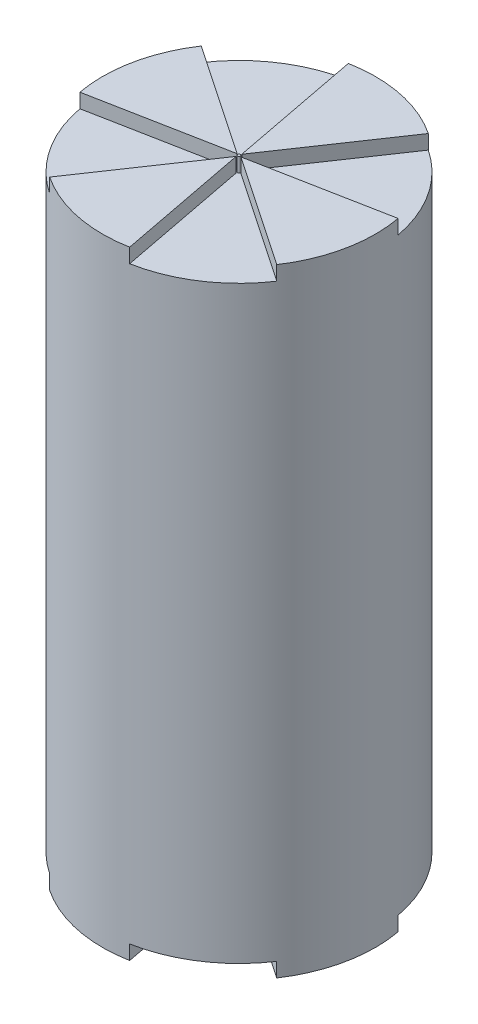
ISO-10303-21;
HEADER;
FILE_DESCRIPTION(('STEP AP214'),'2;1');
FILE_NAME('part.step','',(''),(''),'','','');
FILE_SCHEMA(('AUTOMOTIVE_DESIGN { 1 0 10303 214 1 1 1 1 }'));
ENDSEC;
DATA;
#1=APPLICATION_CONTEXT('core data for automotive mechanical design processes');
#2=APPLICATION_PROTOCOL_DEFINITION('international standard','automotive_design',2000,#1);
#3=PRODUCT_CONTEXT('',#1,'mechanical');
#4=PRODUCT('Part','Part','',(#3));
#5=PRODUCT_RELATED_PRODUCT_CATEGORY('part','',(#4));
#6=PRODUCT_DEFINITION_FORMATION('','',#4);
#7=PRODUCT_DEFINITION_CONTEXT('part definition',#1,'design');
#8=PRODUCT_DEFINITION('design','',#6,#7);
#9=PRODUCT_DEFINITION_SHAPE('','',#8);
#10=(LENGTH_UNIT() NAMED_UNIT(*) SI_UNIT(.MILLI.,.METRE.));
#11=(NAMED_UNIT(*) PLANE_ANGLE_UNIT() SI_UNIT($,.RADIAN.));
#12=(NAMED_UNIT(*) SI_UNIT($,.STERADIAN.) SOLID_ANGLE_UNIT());
#13=UNCERTAINTY_MEASURE_WITH_UNIT(LENGTH_MEASURE(1.E-05),#10,'distance_accuracy_value','');
#14=(GEOMETRIC_REPRESENTATION_CONTEXT(3) GLOBAL_UNCERTAINTY_ASSIGNED_CONTEXT((#13)) GLOBAL_UNIT_ASSIGNED_CONTEXT((#10,
#11,#12)) REPRESENTATION_CONTEXT('',''));
#15=CARTESIAN_POINT('',(0.,0.,0.));
#16=DIRECTION('',(0.,0.,1.));
#17=DIRECTION('',(1.,0.,0.));
#18=AXIS2_PLACEMENT_3D('',#15,#16,#17);
#19=CARTESIAN_POINT('',(0.,109.22,0.));
#20=DIRECTION('',(0.,-1.,0.));
#21=DIRECTION('',(0.,0.,-1.));
#22=AXIS2_PLACEMENT_3D('',#19,#20,#21);
#23=CYLINDRICAL_SURFACE('',#22,24.13);
#24=CARTESIAN_POINT('',(0.,106.68,0.));
#25=DIRECTION('',(0.,1.,0.));
#26=DIRECTION('',(-1.,0.,0.));
#27=AXIS2_PLACEMENT_3D('',#24,#25,#26);
#28=CIRCLE('',#27,24.13);
#29=CARTESIAN_POINT('',(4.39938854928725,106.68,23.725561750829));
#30=VERTEX_POINT('',#29);
#31=CARTESIAN_POINT('',(20.0683998357044,106.68,13.398366618148));
#32=VERTEX_POINT('',#31);
#33=EDGE_CURVE('E335',#30,#32,#28,.T.);
#34=ORIENTED_EDGE('',*,*,#33,.F.);
#35=DIRECTION('',(0.,1.,0.));
#36=VECTOR('',#35,1.);
#37=CARTESIAN_POINT('',(4.39938854928725,106.68,23.725561750829));
#38=LINE('',#37,#36);
#39=CARTESIAN_POINT('',(4.39938854928725,109.22,23.725561750829));
#40=VERTEX_POINT('',#39);
#41=EDGE_CURVE('E348',#30,#40,#38,.T.);
#42=ORIENTED_EDGE('',*,*,#41,.T.);
#43=CARTESIAN_POINT('',(0.,109.22,0.));
#44=DIRECTION('',(0.,1.,0.));
#45=DIRECTION('',(0.,0.,1.));
#46=AXIS2_PLACEMENT_3D('',#43,#44,#45);
#47=CIRCLE('',#46,24.13);
#48=CARTESIAN_POINT('',(-13.398366618148,109.22,20.0683998357043));
#49=VERTEX_POINT('',#48);
#50=EDGE_CURVE('E11',#49,#40,#47,.T.);
#51=ORIENTED_EDGE('',*,*,#50,.F.);
#52=DIRECTION('',(0.,1.,0.));
#53=VECTOR('',#52,1.);
#54=CARTESIAN_POINT('',(-13.398366618148,106.68,20.0683998357043));
#55=LINE('',#54,#53);
#56=CARTESIAN_POINT('',(-13.398366618148,106.68,20.0683998357043));
#57=VERTEX_POINT('',#56);
#58=EDGE_CURVE('E61',#57,#49,#55,.T.);
#59=ORIENTED_EDGE('',*,*,#58,.F.);
#60=CARTESIAN_POINT('',(0.,106.68,0.));
#61=DIRECTION('',(0.,1.,0.));
#62=DIRECTION('',(0.,0.,-1.));
#63=AXIS2_PLACEMENT_3D('',#60,#61,#62);
#64=CIRCLE('',#63,24.13);
#65=CARTESIAN_POINT('',(-23.725561750829,106.68,4.39938854928716));
#66=VERTEX_POINT('',#65);
#67=EDGE_CURVE('E359',#66,#57,#64,.T.);
#68=ORIENTED_EDGE('',*,*,#67,.F.);
#69=DIRECTION('',(0.,1.,0.));
#70=VECTOR('',#69,1.);
#71=CARTESIAN_POINT('',(-23.725561750829,106.68,4.39938854928716));
#72=LINE('',#71,#70);
#73=CARTESIAN_POINT('',(-23.725561750829,109.22,4.39938854928716));
#74=VERTEX_POINT('',#73);
#75=EDGE_CURVE('E377',#66,#74,#72,.T.);
#76=ORIENTED_EDGE('',*,*,#75,.T.);
#77=CARTESIAN_POINT('',(-20.0683998357044,109.22,-13.3983666181478));
#78=VERTEX_POINT('',#77);
#79=EDGE_CURVE('E46',#78,#74,#47,.T.);
#80=ORIENTED_EDGE('',*,*,#79,.F.);
#81=DIRECTION('',(0.,1.,0.));
#82=VECTOR('',#81,1.);
#83=CARTESIAN_POINT('',(-20.0683998357044,106.68,-13.3983666181478));
#84=LINE('',#83,#82);
#85=CARTESIAN_POINT('',(-20.0683998357044,106.68,-13.3983666181478));
#86=VERTEX_POINT('',#85);
#87=EDGE_CURVE('E305',#86,#78,#84,.T.);
#88=ORIENTED_EDGE('',*,*,#87,.F.);
#89=CARTESIAN_POINT('',(0.,106.68,0.));
#90=DIRECTION('',(0.,1.,0.));
#91=DIRECTION('',(1.,0.,0.));
#92=AXIS2_PLACEMENT_3D('',#89,#90,#91);
#93=CIRCLE('',#92,24.13);
#94=CARTESIAN_POINT('',(-4.39938854928741,106.68,-23.725561750829));
#95=VERTEX_POINT('',#94);
#96=EDGE_CURVE('E296',#95,#86,#93,.T.);
#97=ORIENTED_EDGE('',*,*,#96,.F.);
#98=DIRECTION('',(0.,1.,0.));
#99=VECTOR('',#98,1.);
#100=CARTESIAN_POINT('',(-4.39938854928741,106.68,-23.725561750829));
#101=LINE('',#100,#99);
#102=CARTESIAN_POINT('',(-4.39938854928741,109.22,-23.725561750829));
#103=VERTEX_POINT('',#102);
#104=EDGE_CURVE('E308',#95,#103,#101,.T.);
#105=ORIENTED_EDGE('',*,*,#104,.T.);
#106=CARTESIAN_POINT('',(13.398366618148,109.22,-20.0683998357043));
#107=VERTEX_POINT('',#106);
#108=EDGE_CURVE('E393',#107,#103,#47,.T.);
#109=ORIENTED_EDGE('',*,*,#108,.F.);
#110=DIRECTION('',(0.,1.,0.));
#111=VECTOR('',#110,1.);
#112=CARTESIAN_POINT('',(13.398366618148,106.68,-20.0683998357043));
#113=LINE('',#112,#111);
#114=CARTESIAN_POINT('',(13.398366618148,106.68,-20.0683998357043));
#115=VERTEX_POINT('',#114);
#116=EDGE_CURVE('E324',#115,#107,#113,.T.);
#117=ORIENTED_EDGE('',*,*,#116,.F.);
#118=CARTESIAN_POINT('',(0.,106.68,0.));
#119=DIRECTION('',(0.,1.,0.));
#120=DIRECTION('',(0.,0.,1.));
#121=AXIS2_PLACEMENT_3D('',#118,#119,#120);
#122=CIRCLE('',#121,24.13);
#123=CARTESIAN_POINT('',(23.725561750829,106.68,-4.39938854928716));
#124=VERTEX_POINT('',#123);
#125=EDGE_CURVE('E315',#124,#115,#122,.T.);
#126=ORIENTED_EDGE('',*,*,#125,.F.);
#127=DIRECTION('',(0.,1.,0.));
#128=VECTOR('',#127,1.);
#129=CARTESIAN_POINT('',(23.725561750829,106.68,-4.39938854928716));
#130=LINE('',#129,#128);
#131=CARTESIAN_POINT('',(23.725561750829,109.22,-4.39938854928716));
#132=VERTEX_POINT('',#131);
#133=EDGE_CURVE('E328',#124,#132,#130,.T.);
#134=ORIENTED_EDGE('',*,*,#133,.T.);
#135=CARTESIAN_POINT('',(20.0683998357044,109.22,13.398366618148));
#136=VERTEX_POINT('',#135);
#137=EDGE_CURVE('E45',#136,#132,#47,.T.);
#138=ORIENTED_EDGE('',*,*,#137,.F.);
#139=DIRECTION('',(0.,1.,0.));
#140=VECTOR('',#139,1.);
#141=CARTESIAN_POINT('',(20.0683998357044,106.68,13.398366618148));
#142=LINE('',#141,#140);
#143=EDGE_CURVE('E344',#32,#136,#142,.T.);
#144=ORIENTED_EDGE('',*,*,#143,.F.);
#145=EDGE_LOOP('',(#34,#42,#51,#59,#68,#76,#80,#88,#97,#105,#109,#117,#126,#134,#138,#144));
#146=FACE_BOUND('',#145,.T.);
#147=DIRECTION('',(0.,-1.,0.));
#148=VECTOR('',#147,1.);
#149=CARTESIAN_POINT('',(-13.398366618148,2.54,20.0683998357043));
#150=LINE('',#149,#148);
#151=CARTESIAN_POINT('',(-13.398366618148,2.54,20.0683998357043));
#152=VERTEX_POINT('',#151);
#153=CARTESIAN_POINT('',(-13.398366618148,0.,20.0683998357043));
#154=VERTEX_POINT('',#153);
#155=EDGE_CURVE('E292',#152,#154,#150,.T.);
#156=ORIENTED_EDGE('',*,*,#155,.T.);
#157=CARTESIAN_POINT('',(0.,0.,0.));
#158=DIRECTION('',(0.,1.,0.));
#159=DIRECTION('',(0.,0.,1.));
#160=AXIS2_PLACEMENT_3D('',#157,#158,#159);
#161=CIRCLE('',#160,24.13);
#162=CARTESIAN_POINT('',(4.39938854928725,0.,23.725561750829));
#163=VERTEX_POINT('',#162);
#164=EDGE_CURVE('E40',#154,#163,#161,.T.);
#165=ORIENTED_EDGE('',*,*,#164,.T.);
#166=DIRECTION('',(0.,-1.,0.));
#167=VECTOR('',#166,1.);
#168=CARTESIAN_POINT('',(4.39938854928725,2.54,23.725561750829));
#169=LINE('',#168,#167);
#170=CARTESIAN_POINT('',(4.39938854928725,2.54,23.725561750829));
#171=VERTEX_POINT('',#170);
#172=EDGE_CURVE('E256',#171,#163,#169,.T.);
#173=ORIENTED_EDGE('',*,*,#172,.F.);
#174=CARTESIAN_POINT('',(0.,2.54,0.));
#175=DIRECTION('',(0.,1.,0.));
#176=DIRECTION('',(-1.,0.,0.));
#177=AXIS2_PLACEMENT_3D('',#174,#175,#176);
#178=CIRCLE('',#177,24.13);
#179=CARTESIAN_POINT('',(20.0683998357044,2.54,13.398366618148));
#180=VERTEX_POINT('',#179);
#181=EDGE_CURVE('E247',#171,#180,#178,.T.);
#182=ORIENTED_EDGE('',*,*,#181,.T.);
#183=DIRECTION('',(0.,-1.,0.));
#184=VECTOR('',#183,1.);
#185=CARTESIAN_POINT('',(20.0683998357044,2.54,13.398366618148));
#186=LINE('',#185,#184);
#187=CARTESIAN_POINT('',(20.0683998357044,0.,13.398366618148));
#188=VERTEX_POINT('',#187);
#189=EDGE_CURVE('E261',#180,#188,#186,.T.);
#190=ORIENTED_EDGE('',*,*,#189,.T.);
#191=CARTESIAN_POINT('',(23.725561750829,0.,-4.39938854928716));
#192=VERTEX_POINT('',#191);
#193=EDGE_CURVE('E386',#188,#192,#161,.T.);
#194=ORIENTED_EDGE('',*,*,#193,.T.);
#195=DIRECTION('',(0.,-1.,0.));
#196=VECTOR('',#195,1.);
#197=CARTESIAN_POINT('',(23.725561750829,2.54,-4.39938854928716));
#198=LINE('',#197,#196);
#199=CARTESIAN_POINT('',(23.725561750829,2.54,-4.39938854928716));
#200=VERTEX_POINT('',#199);
#201=EDGE_CURVE('E236',#200,#192,#198,.T.);
#202=ORIENTED_EDGE('',*,*,#201,.F.);
#203=CARTESIAN_POINT('',(0.,2.54,0.));
#204=DIRECTION('',(0.,1.,0.));
#205=DIRECTION('',(0.,0.,1.));
#206=AXIS2_PLACEMENT_3D('',#203,#204,#205);
#207=CIRCLE('',#206,24.13);
#208=CARTESIAN_POINT('',(13.398366618148,2.54,-20.0683998357043));
#209=VERTEX_POINT('',#208);
#210=EDGE_CURVE('E228',#200,#209,#207,.T.);
#211=ORIENTED_EDGE('',*,*,#210,.T.);
#212=DIRECTION('',(0.,-1.,0.));
#213=VECTOR('',#212,1.);
#214=CARTESIAN_POINT('',(13.398366618148,2.54,-20.0683998357043));
#215=LINE('',#214,#213);
#216=CARTESIAN_POINT('',(13.398366618148,0.,-20.0683998357043));
#217=VERTEX_POINT('',#216);
#218=EDGE_CURVE('E241',#209,#217,#215,.T.);
#219=ORIENTED_EDGE('',*,*,#218,.T.);
#220=CARTESIAN_POINT('',(-4.39938854928741,0.,-23.725561750829));
#221=VERTEX_POINT('',#220);
#222=EDGE_CURVE('E220',#217,#221,#161,.T.);
#223=ORIENTED_EDGE('',*,*,#222,.T.);
#224=DIRECTION('',(0.,-1.,0.));
#225=VECTOR('',#224,1.);
#226=CARTESIAN_POINT('',(-4.39938854928741,2.54,-23.725561750829));
#227=LINE('',#226,#225);
#228=CARTESIAN_POINT('',(-4.39938854928741,2.54,-23.725561750829));
#229=VERTEX_POINT('',#228);
#230=EDGE_CURVE('E53',#229,#221,#227,.T.);
#231=ORIENTED_EDGE('',*,*,#230,.F.);
#232=CARTESIAN_POINT('',(0.,2.54,0.));
#233=DIRECTION('',(0.,1.,0.));
#234=DIRECTION('',(1.,0.,0.));
#235=AXIS2_PLACEMENT_3D('',#232,#233,#234);
#236=CIRCLE('',#235,24.13);
#237=CARTESIAN_POINT('',(-20.0683998357044,2.54,-13.3983666181478));
#238=VERTEX_POINT('',#237);
#239=EDGE_CURVE('E206',#229,#238,#236,.T.);
#240=ORIENTED_EDGE('',*,*,#239,.T.);
#241=DIRECTION('',(0.,-1.,0.));
#242=VECTOR('',#241,1.);
#243=CARTESIAN_POINT('',(-20.0683998357044,2.54,-13.3983666181478));
#244=LINE('',#243,#242);
#245=CARTESIAN_POINT('',(-20.0683998357044,0.,-13.3983666181478));
#246=VERTEX_POINT('',#245);
#247=EDGE_CURVE('E221',#238,#246,#244,.T.);
#248=ORIENTED_EDGE('',*,*,#247,.T.);
#249=CARTESIAN_POINT('',(-23.725561750829,0.,4.39938854928716));
#250=VERTEX_POINT('',#249);
#251=EDGE_CURVE('E385',#246,#250,#161,.T.);
#252=ORIENTED_EDGE('',*,*,#251,.T.);
#253=DIRECTION('',(0.,-1.,0.));
#254=VECTOR('',#253,1.);
#255=CARTESIAN_POINT('',(-23.725561750829,2.54,4.39938854928716));
#256=LINE('',#255,#254);
#257=CARTESIAN_POINT('',(-23.725561750829,2.54,4.39938854928716));
#258=VERTEX_POINT('',#257);
#259=EDGE_CURVE('E284',#258,#250,#256,.T.);
#260=ORIENTED_EDGE('',*,*,#259,.F.);
#261=CARTESIAN_POINT('',(0.,2.54,0.));
#262=DIRECTION('',(0.,1.,0.));
#263=DIRECTION('',(0.,0.,-1.));
#264=AXIS2_PLACEMENT_3D('',#261,#262,#263);
#265=CIRCLE('',#264,24.13);
#266=EDGE_CURVE('E272',#258,#152,#265,.T.);
#267=ORIENTED_EDGE('',*,*,#266,.T.);
#268=EDGE_LOOP('',(#156,#165,#173,#182,#190,#194,#202,#211,#219,#223,#231,#240,#248,#252,#260,#267));
#269=FACE_BOUND('',#268,.T.);
#270=ADVANCED_FACE('F37',(#146,#269),#23,.T.);
#271=CARTESIAN_POINT('',(0.,0.,0.));
#272=DIRECTION('',(0.,1.,0.));
#273=DIRECTION('',(0.,0.,1.));
#274=AXIS2_PLACEMENT_3D('',#271,#272,#273);
#275=PLANE('',#274);
#276=DIRECTION('',(0.560808959095651,0.,-0.827945234540337));
#277=VECTOR('',#276,1.);
#278=CARTESIAN_POINT('',(-13.398366618148,0.,20.0683998357043));
#279=LINE('',#278,#277);
#280=CARTESIAN_POINT('',(-0.0849040867862483,0.,0.413189840757915));
#281=VERTEX_POINT('',#280);
#282=EDGE_CURVE('E276',#154,#281,#279,.T.);
#283=ORIENTED_EDGE('',*,*,#282,.T.);
#284=DIRECTION('',(0.188893871867864,0.,0.98199750772126));
#285=VECTOR('',#284,1.);
#286=CARTESIAN_POINT('',(-0.121475110096735,0.,0.223069042287327));
#287=LINE('',#286,#285);
#288=EDGE_CURVE('E246',#281,#163,#287,.T.);
#289=ORIENTED_EDGE('',*,*,#288,.T.);
#290=ORIENTED_EDGE('',*,*,#164,.F.);
#291=EDGE_LOOP('',(#283,#289,#290));
#292=FACE_BOUND('',#291,.T.);
#293=ADVANCED_FACE('F452',(#292),#275,.F.);
#294=DIRECTION('',(-0.981997507721261,0.,0.188893871867861));
#295=VECTOR('',#294,1.);
#296=CARTESIAN_POINT('',(-0.223069042287327,0.,-0.121475110096735));
#297=LINE('',#296,#295);
#298=CARTESIAN_POINT('',(-0.413189840757908,0.,-0.0849040867862455));
#299=VERTEX_POINT('',#298);
#300=EDGE_CURVE('E271',#299,#250,#297,.T.);
#301=ORIENTED_EDGE('',*,*,#300,.T.);
#302=ORIENTED_EDGE('',*,*,#251,.F.);
#303=DIRECTION('',(0.827945234540343,0.,0.560808959095642));
#304=VECTOR('',#303,1.);
#305=CARTESIAN_POINT('',(-20.0683998357044,0.,-13.3983666181478));
#306=LINE('',#305,#304);
#307=EDGE_CURVE('E214',#246,#299,#306,.T.);
#308=ORIENTED_EDGE('',*,*,#307,.T.);
#309=EDGE_LOOP('',(#301,#302,#308));
#310=FACE_BOUND('',#309,.T.);
#311=ADVANCED_FACE('F456',(#310),#275,.F.);
#312=DIRECTION('',(-0.827945234540339,0.,-0.560808959095648));
#313=VECTOR('',#312,1.);
#314=CARTESIAN_POINT('',(20.0683998357044,0.,13.398366618148));
#315=LINE('',#314,#313);
#316=CARTESIAN_POINT('',(0.413189840757909,0.,0.084904086786247));
#317=VERTEX_POINT('',#316);
#318=EDGE_CURVE('E251',#188,#317,#315,.T.);
#319=ORIENTED_EDGE('',*,*,#318,.T.);
#320=DIRECTION('',(0.981997507721261,0.,-0.188893871867861));
#321=VECTOR('',#320,1.);
#322=CARTESIAN_POINT('',(0.223069042287327,0.,0.121475110096735));
#323=LINE('',#322,#321);
#324=EDGE_CURVE('E223',#317,#192,#323,.T.);
#325=ORIENTED_EDGE('',*,*,#324,.T.);
#326=ORIENTED_EDGE('',*,*,#193,.F.);
#327=EDGE_LOOP('',(#319,#325,#326));
#328=FACE_BOUND('',#327,.T.);
#329=ADVANCED_FACE('F462',(#328),#275,.F.);
#330=DIRECTION('',(-0.560808959095651,0.,0.827945234540337));
#331=VECTOR('',#330,1.);
#332=CARTESIAN_POINT('',(13.398366618148,0.,-20.0683998357043));
#333=LINE('',#332,#331);
#334=CARTESIAN_POINT('',(0.0849040867862416,0.,-0.413189840757899));
#335=VERTEX_POINT('',#334);
#336=EDGE_CURVE('E232',#217,#335,#333,.T.);
#337=ORIENTED_EDGE('',*,*,#336,.T.);
#338=DIRECTION('',(-0.188893871867871,0.,-0.981997507721259));
#339=VECTOR('',#338,1.);
#340=CARTESIAN_POINT('',(0.121475110096733,0.,-0.223069042287328));
#341=LINE('',#340,#339);
#342=EDGE_CURVE('E479',#335,#221,#341,.T.);
#343=ORIENTED_EDGE('',*,*,#342,.T.);
#344=ORIENTED_EDGE('',*,*,#222,.F.);
#345=EDGE_LOOP('',(#337,#343,#344));
#346=FACE_BOUND('',#345,.T.);
#347=ADVANCED_FACE('F466',(#346),#275,.F.);
#348=CARTESIAN_POINT('',(0.,109.22,0.));
#349=DIRECTION('',(0.,1.,0.));
#350=DIRECTION('',(0.,0.,1.));
#351=AXIS2_PLACEMENT_3D('',#348,#349,#350);
#352=PLANE('',#351);
#353=DIRECTION('',(0.188893871867864,0.,0.98199750772126));
#354=VECTOR('',#353,1.);
#355=CARTESIAN_POINT('',(-0.121475110096735,109.22,0.223069042287327));
#356=LINE('',#355,#354);
#357=CARTESIAN_POINT('',(-0.0849040867862434,109.22,0.413189840757894));
#358=VERTEX_POINT('',#357);
#359=EDGE_CURVE('E339',#358,#40,#356,.T.);
#360=ORIENTED_EDGE('',*,*,#359,.F.);
#361=DIRECTION('',(0.560808959095651,0.,-0.827945234540337));
#362=VECTOR('',#361,1.);
#363=CARTESIAN_POINT('',(-13.398366618148,109.22,20.0683998357043));
#364=LINE('',#363,#362);
#365=EDGE_CURVE('E358',#49,#358,#364,.T.);
#366=ORIENTED_EDGE('',*,*,#365,.F.);
#367=ORIENTED_EDGE('',*,*,#50,.T.);
#368=EDGE_LOOP('',(#360,#366,#367));
#369=FACE_BOUND('',#368,.T.);
#370=ADVANCED_FACE('F426',(#369),#352,.T.);
#371=CARTESIAN_POINT('',(0.,109.22,0.));
#372=DIRECTION('',(0.,-1.,0.));
#373=DIRECTION('',(0.,0.,-1.));
#374=AXIS2_PLACEMENT_3D('',#371,#372,#373);
#375=CIRCLE('',#374,0.253999999999996);
#376=CARTESIAN_POINT('',(0.,109.22,-0.253999999999996));
#377=VERTEX_POINT('',#376);
#378=EDGE_CURVE('E372',#377,#377,#375,.T.);
#379=ORIENTED_EDGE('',*,*,#378,.F.);
#380=EDGE_LOOP('',(#379));
#381=FACE_BOUND('',#380,.T.);
#382=ADVANCED_FACE('F449',(#381),#352,.T.);
#383=DIRECTION('',(-0.827945234540339,0.,-0.560808959095648));
#384=VECTOR('',#383,1.);
#385=CARTESIAN_POINT('',(20.0683998357044,109.22,13.398366618148));
#386=LINE('',#385,#384);
#387=CARTESIAN_POINT('',(0.413189840757908,109.22,0.0849040867862454));
#388=VERTEX_POINT('',#387);
#389=EDGE_CURVE('E334',#136,#388,#386,.T.);
#390=ORIENTED_EDGE('',*,*,#389,.F.);
#391=ORIENTED_EDGE('',*,*,#137,.T.);
#392=DIRECTION('',(0.981997507721261,0.,-0.188893871867861));
#393=VECTOR('',#392,1.);
#394=CARTESIAN_POINT('',(0.223069042287327,109.22,0.121475110096735));
#395=LINE('',#394,#393);
#396=EDGE_CURVE('E319',#388,#132,#395,.T.);
#397=ORIENTED_EDGE('',*,*,#396,.F.);
#398=EDGE_LOOP('',(#390,#391,#397));
#399=FACE_BOUND('',#398,.T.);
#400=ADVANCED_FACE('F407',(#399),#352,.T.);
#401=DIRECTION('',(-0.560808959095651,0.,0.827945234540337));
#402=VECTOR('',#401,1.);
#403=CARTESIAN_POINT('',(13.398366618148,109.22,-20.0683998357043));
#404=LINE('',#403,#402);
#405=CARTESIAN_POINT('',(0.0849040867862425,109.22,-0.413189840757902));
#406=VERTEX_POINT('',#405);
#407=EDGE_CURVE('E314',#107,#406,#404,.T.);
#408=ORIENTED_EDGE('',*,*,#407,.F.);
#409=ORIENTED_EDGE('',*,*,#108,.T.);
#410=DIRECTION('',(-0.188893871867871,0.,-0.981997507721259));
#411=VECTOR('',#410,1.);
#412=CARTESIAN_POINT('',(0.121475110096733,109.22,-0.223069042287328));
#413=LINE('',#412,#411);
#414=EDGE_CURVE('E300',#406,#103,#413,.T.);
#415=ORIENTED_EDGE('',*,*,#414,.F.);
#416=EDGE_LOOP('',(#408,#409,#415));
#417=FACE_BOUND('',#416,.T.);
#418=ADVANCED_FACE('F442',(#417),#352,.T.);
#419=DIRECTION('',(0.827945234540343,0.,0.560808959095642));
#420=VECTOR('',#419,1.);
#421=CARTESIAN_POINT('',(-20.0683998357044,109.22,-13.3983666181478));
#422=LINE('',#421,#420);
#423=CARTESIAN_POINT('',(-0.413189840757909,109.22,-0.0849040867862451));
#424=VERTEX_POINT('',#423);
#425=EDGE_CURVE('E294',#78,#424,#422,.T.);
#426=ORIENTED_EDGE('',*,*,#425,.F.);
#427=ORIENTED_EDGE('',*,*,#79,.T.);
#428=DIRECTION('',(-0.981997507721261,0.,0.188893871867861));
#429=VECTOR('',#428,1.);
#430=CARTESIAN_POINT('',(-0.223069042287327,109.22,-0.121475110096735));
#431=LINE('',#430,#429);
#432=EDGE_CURVE('E363',#424,#74,#431,.T.);
#433=ORIENTED_EDGE('',*,*,#432,.F.);
#434=EDGE_LOOP('',(#426,#427,#433));
#435=FACE_BOUND('',#434,.T.);
#436=ADVANCED_FACE('F431',(#435),#352,.T.);
#437=CARTESIAN_POINT('',(-0.223069042287327,106.68,-0.121475110096735));
#438=DIRECTION('',(-0.188893871867861,0.,-0.981997507721261));
#439=DIRECTION('',(-0.981997507721261,0.,0.188893871867861));
#440=AXIS2_PLACEMENT_3D('',#437,#438,#439);
#441=PLANE('',#440);
#442=DIRECTION('',(-0.981997507721261,0.,0.188893871867861));
#443=VECTOR('',#442,1.);
#444=CARTESIAN_POINT('',(-0.223069042287327,106.68,-0.121475110096735));
#445=LINE('',#444,#443);
#446=CARTESIAN_POINT('',(-0.413189840757909,106.68,-0.0849040867862451));
#447=VERTEX_POINT('',#446);
#448=EDGE_CURVE('E369',#447,#66,#445,.T.);
#449=ORIENTED_EDGE('',*,*,#448,.F.);
#450=DIRECTION('',(0.,1.,0.));
#451=VECTOR('',#450,1.);
#452=CARTESIAN_POINT('',(-0.413189840757908,106.68,-0.0849040867862454));
#453=LINE('',#452,#451);
#454=EDGE_CURVE('E351',#447,#424,#453,.T.);
#455=ORIENTED_EDGE('',*,*,#454,.T.);
#456=ORIENTED_EDGE('',*,*,#432,.T.);
#457=ORIENTED_EDGE('',*,*,#75,.F.);
#458=EDGE_LOOP('',(#449,#455,#456,#457));
#459=FACE_BOUND('',#458,.T.);
#460=ADVANCED_FACE('F430',(#459),#441,.F.);
#461=CARTESIAN_POINT('',(0.,106.68,0.));
#462=DIRECTION('',(0.,1.,0.));
#463=DIRECTION('',(0.,0.,1.));
#464=AXIS2_PLACEMENT_3D('',#461,#462,#463);
#465=CYLINDRICAL_SURFACE('',#464,0.253999999999996);
#466=ORIENTED_EDGE('',*,*,#378,.T.);
#467=EDGE_LOOP('',(#466));
#468=FACE_BOUND('',#467,.T.);
#469=CARTESIAN_POINT('',(0.,106.68,0.));
#470=DIRECTION('',(0.,-1.,0.));
#471=DIRECTION('',(0.,0.,-1.));
#472=AXIS2_PLACEMENT_3D('',#469,#470,#471);
#473=CIRCLE('',#472,0.253999999999996);
#474=CARTESIAN_POINT('',(0.,106.68,-0.253999999999996));
#475=VERTEX_POINT('',#474);
#476=EDGE_CURVE('E366',#475,#475,#473,.T.);
#477=ORIENTED_EDGE('',*,*,#476,.F.);
#478=EDGE_LOOP('',(#477));
#479=FACE_BOUND('',#478,.T.);
#480=ADVANCED_FACE('F549',(#468,#479),#465,.T.);
#481=CARTESIAN_POINT('',(-13.398366618148,106.68,20.0683998357043));
#482=DIRECTION('',(0.827945234540337,0.,0.560808959095651));
#483=DIRECTION('',(0.560808959095651,0.,-0.827945234540337));
#484=AXIS2_PLACEMENT_3D('',#481,#482,#483);
#485=PLANE('',#484);
#486=ORIENTED_EDGE('',*,*,#365,.T.);
#487=DIRECTION('',(0.,-1.,0.));
#488=VECTOR('',#487,1.);
#489=CARTESIAN_POINT('',(-0.0849040867862434,106.68,0.413189840757902));
#490=LINE('',#489,#488);
#491=CARTESIAN_POINT('',(-0.0849040867862429,106.68,0.413189840757914));
#492=VERTEX_POINT('',#491);
#493=EDGE_CURVE('E355',#358,#492,#490,.T.);
#494=ORIENTED_EDGE('',*,*,#493,.T.);
#495=DIRECTION('',(0.560808959095651,0.,-0.827945234540337));
#496=VECTOR('',#495,1.);
#497=CARTESIAN_POINT('',(-13.398366618148,106.68,20.0683998357043));
#498=LINE('',#497,#496);
#499=EDGE_CURVE('E362',#57,#492,#498,.T.);
#500=ORIENTED_EDGE('',*,*,#499,.F.);
#501=ORIENTED_EDGE('',*,*,#58,.T.);
#502=EDGE_LOOP('',(#486,#494,#500,#501));
#503=FACE_BOUND('',#502,.T.);
#504=ADVANCED_FACE('F427',(#503),#485,.F.);
#505=CARTESIAN_POINT('',(0.,106.68,0.));
#506=DIRECTION('',(0.,-1.,0.));
#507=DIRECTION('',(0.,0.,-1.));
#508=AXIS2_PLACEMENT_3D('',#505,#506,#507);
#509=PLANE('',#508);
#510=DIRECTION('',(0.827945234540343,0.,0.560808959095642));
#511=VECTOR('',#510,1.);
#512=CARTESIAN_POINT('',(-20.0683998357044,106.68,-13.3983666181478));
#513=LINE('',#512,#511);
#514=EDGE_CURVE('E299',#86,#447,#513,.T.);
#515=ORIENTED_EDGE('',*,*,#514,.T.);
#516=ORIENTED_EDGE('',*,*,#448,.T.);
#517=ORIENTED_EDGE('',*,*,#67,.T.);
#518=ORIENTED_EDGE('',*,*,#499,.T.);
#519=DIRECTION('',(0.188893871867864,0.,0.98199750772126));
#520=VECTOR('',#519,1.);
#521=CARTESIAN_POINT('',(-0.121475110096735,106.68,0.223069042287327));
#522=LINE('',#521,#520);
#523=EDGE_CURVE('E342',#492,#30,#522,.T.);
#524=ORIENTED_EDGE('',*,*,#523,.T.);
#525=ORIENTED_EDGE('',*,*,#33,.T.);
#526=DIRECTION('',(-0.827945234540339,0.,-0.560808959095648));
#527=VECTOR('',#526,1.);
#528=CARTESIAN_POINT('',(20.0683998357044,106.68,13.398366618148));
#529=LINE('',#528,#527);
#530=CARTESIAN_POINT('',(0.413189840757908,106.68,0.0849040867862454));
#531=VERTEX_POINT('',#530);
#532=EDGE_CURVE('E338',#32,#531,#529,.T.);
#533=ORIENTED_EDGE('',*,*,#532,.T.);
#534=DIRECTION('',(0.981997507721261,0.,-0.188893871867861));
#535=VECTOR('',#534,1.);
#536=CARTESIAN_POINT('',(0.223069042287327,106.68,0.121475110096735));
#537=LINE('',#536,#535);
#538=EDGE_CURVE('E322',#531,#124,#537,.T.);
#539=ORIENTED_EDGE('',*,*,#538,.T.);
#540=ORIENTED_EDGE('',*,*,#125,.T.);
#541=DIRECTION('',(-0.560808959095651,0.,0.827945234540337));
#542=VECTOR('',#541,1.);
#543=CARTESIAN_POINT('',(13.398366618148,106.68,-20.0683998357043));
#544=LINE('',#543,#542);
#545=CARTESIAN_POINT('',(0.0849040867862425,106.68,-0.413189840757902));
#546=VERTEX_POINT('',#545);
#547=EDGE_CURVE('E318',#115,#546,#544,.T.);
#548=ORIENTED_EDGE('',*,*,#547,.T.);
#549=DIRECTION('',(-0.188893871867871,0.,-0.981997507721259));
#550=VECTOR('',#549,1.);
#551=CARTESIAN_POINT('',(0.121475110096733,106.68,-0.223069042287328));
#552=LINE('',#551,#550);
#553=EDGE_CURVE('E303',#546,#95,#552,.T.);
#554=ORIENTED_EDGE('',*,*,#553,.T.);
#555=ORIENTED_EDGE('',*,*,#96,.T.);
#556=EDGE_LOOP('',(#515,#516,#517,#518,#524,#525,#533,#539,#540,#548,#554,#555));
#557=FACE_BOUND('',#556,.T.);
#558=ORIENTED_EDGE('',*,*,#476,.T.);
#559=EDGE_LOOP('',(#558));
#560=FACE_BOUND('',#559,.T.);
#561=ADVANCED_FACE('F419',(#557,#560),#509,.F.);
#562=CARTESIAN_POINT('',(-0.121475110096735,106.68,0.223069042287327));
#563=DIRECTION('',(-0.98199750772126,0.,0.188893871867864));
#564=DIRECTION('',(0.188893871867864,0.,0.981997507721261));
#565=AXIS2_PLACEMENT_3D('',#562,#563,#564);
#566=PLANE('',#565);
#567=ORIENTED_EDGE('',*,*,#359,.T.);
#568=ORIENTED_EDGE('',*,*,#41,.F.);
#569=ORIENTED_EDGE('',*,*,#523,.F.);
#570=ORIENTED_EDGE('',*,*,#493,.F.);
#571=EDGE_LOOP('',(#567,#568,#569,#570));
#572=FACE_BOUND('',#571,.T.);
#573=ADVANCED_FACE('F536',(#572),#566,.F.);
#574=CARTESIAN_POINT('',(-20.0683998357044,106.68,-13.3983666181478));
#575=DIRECTION('',(-0.560808959095642,0.,0.827945234540342));
#576=DIRECTION('',(0.827945234540343,0.,0.560808959095642));
#577=AXIS2_PLACEMENT_3D('',#574,#575,#576);
#578=PLANE('',#577);
#579=ORIENTED_EDGE('',*,*,#514,.F.);
#580=ORIENTED_EDGE('',*,*,#87,.T.);
#581=ORIENTED_EDGE('',*,*,#425,.T.);
#582=ORIENTED_EDGE('',*,*,#454,.F.);
#583=EDGE_LOOP('',(#579,#580,#581,#582));
#584=FACE_BOUND('',#583,.T.);
#585=ADVANCED_FACE('F435',(#584),#578,.F.);
#586=CARTESIAN_POINT('',(20.0683998357044,106.68,13.398366618148));
#587=DIRECTION('',(0.560808959095648,0.,-0.827945234540339));
#588=DIRECTION('',(-0.827945234540339,0.,-0.560808959095648));
#589=AXIS2_PLACEMENT_3D('',#586,#587,#588);
#590=PLANE('',#589);
#591=DIRECTION('',(0.,-1.,0.));
#592=VECTOR('',#591,1.);
#593=CARTESIAN_POINT('',(0.413189840757906,106.68,0.0849040867862468));
#594=LINE('',#593,#592);
#595=EDGE_CURVE('E331',#388,#531,#594,.T.);
#596=ORIENTED_EDGE('',*,*,#595,.T.);
#597=ORIENTED_EDGE('',*,*,#532,.F.);
#598=ORIENTED_EDGE('',*,*,#143,.T.);
#599=ORIENTED_EDGE('',*,*,#389,.T.);
#600=EDGE_LOOP('',(#596,#597,#598,#599));
#601=FACE_BOUND('',#600,.T.);
#602=ADVANCED_FACE('F417',(#601),#590,.F.);
#603=CARTESIAN_POINT('',(0.223069042287327,106.68,0.121475110096735));
#604=DIRECTION('',(0.188893871867861,0.,0.981997507721261));
#605=DIRECTION('',(0.981997507721261,0.,-0.188893871867861));
#606=AXIS2_PLACEMENT_3D('',#603,#604,#605);
#607=PLANE('',#606);
#608=ORIENTED_EDGE('',*,*,#396,.T.);
#609=ORIENTED_EDGE('',*,*,#133,.F.);
#610=ORIENTED_EDGE('',*,*,#538,.F.);
#611=ORIENTED_EDGE('',*,*,#595,.F.);
#612=EDGE_LOOP('',(#608,#609,#610,#611));
#613=FACE_BOUND('',#612,.T.);
#614=ADVANCED_FACE('F415',(#613),#607,.F.);
#615=CARTESIAN_POINT('',(13.398366618148,106.68,-20.0683998357043));
#616=DIRECTION('',(-0.827945234540337,0.,-0.560808959095651));
#617=DIRECTION('',(-0.560808959095651,0.,0.827945234540337));
#618=AXIS2_PLACEMENT_3D('',#615,#616,#617);
#619=PLANE('',#618);
#620=DIRECTION('',(0.,-1.,0.));
#621=VECTOR('',#620,1.);
#622=CARTESIAN_POINT('',(0.0849040867862434,106.68,-0.413189840757902));
#623=LINE('',#622,#621);
#624=EDGE_CURVE('E311',#406,#546,#623,.T.);
#625=ORIENTED_EDGE('',*,*,#624,.T.);
#626=ORIENTED_EDGE('',*,*,#547,.F.);
#627=ORIENTED_EDGE('',*,*,#116,.T.);
#628=ORIENTED_EDGE('',*,*,#407,.T.);
#629=EDGE_LOOP('',(#625,#626,#627,#628));
#630=FACE_BOUND('',#629,.T.);
#631=ADVANCED_FACE('F441',(#630),#619,.F.);
#632=CARTESIAN_POINT('',(0.121475110096733,106.68,-0.223069042287328));
#633=DIRECTION('',(0.981997507721259,0.,-0.188893871867871));
#634=DIRECTION('',(-0.188893871867871,0.,-0.981997507721259));
#635=AXIS2_PLACEMENT_3D('',#632,#633,#634);
#636=PLANE('',#635);
#637=ORIENTED_EDGE('',*,*,#414,.T.);
#638=ORIENTED_EDGE('',*,*,#104,.F.);
#639=ORIENTED_EDGE('',*,*,#553,.F.);
#640=ORIENTED_EDGE('',*,*,#624,.F.);
#641=EDGE_LOOP('',(#637,#638,#639,#640));
#642=FACE_BOUND('',#641,.T.);
#643=ADVANCED_FACE('F439',(#642),#636,.F.);
#644=CARTESIAN_POINT('',(-13.398366618148,2.54,20.0683998357043));
#645=DIRECTION('',(-0.827945234540337,0.,-0.560808959095651));
#646=DIRECTION('',(-0.560808959095651,0.,0.827945234540337));
#647=AXIS2_PLACEMENT_3D('',#644,#645,#646);
#648=PLANE('',#647);
#649=DIRECTION('',(0.,-1.,0.));
#650=VECTOR('',#649,1.);
#651=CARTESIAN_POINT('',(-0.0849040867862434,2.54,0.413189840757902));
#652=LINE('',#651,#650);
#653=CARTESIAN_POINT('',(-0.0849040867862483,2.54,0.413189840757915));
#654=VERTEX_POINT('',#653);
#655=EDGE_CURVE('E269',#654,#281,#652,.T.);
#656=ORIENTED_EDGE('',*,*,#655,.T.);
#657=ORIENTED_EDGE('',*,*,#282,.F.);
#658=ORIENTED_EDGE('',*,*,#155,.F.);
#659=DIRECTION('',(0.560808959095651,0.,-0.827945234540337));
#660=VECTOR('',#659,1.);
#661=CARTESIAN_POINT('',(-13.398366618148,2.54,20.0683998357043));
#662=LINE('',#661,#660);
#663=EDGE_CURVE('E281',#152,#654,#662,.T.);
#664=ORIENTED_EDGE('',*,*,#663,.T.);
#665=EDGE_LOOP('',(#656,#657,#658,#664));
#666=FACE_BOUND('',#665,.T.);
#667=ADVANCED_FACE('F498',(#666),#648,.T.);
#668=CARTESIAN_POINT('',(-0.223069042287327,2.54,-0.121475110096735));
#669=DIRECTION('',(0.188893871867861,0.,0.981997507721261));
#670=DIRECTION('',(0.981997507721261,0.,-0.188893871867861));
#671=AXIS2_PLACEMENT_3D('',#668,#669,#670);
#672=PLANE('',#671);
#673=DIRECTION('',(0.,1.,0.));
#674=VECTOR('',#673,1.);
#675=CARTESIAN_POINT('',(-0.413189840757908,2.54,-0.0849040867862454));
#676=LINE('',#675,#674);
#677=CARTESIAN_POINT('',(-0.413189840757909,2.54,-0.0849040867862451));
#678=VERTEX_POINT('',#677);
#679=EDGE_CURVE('E266',#299,#678,#676,.T.);
#680=ORIENTED_EDGE('',*,*,#679,.T.);
#681=DIRECTION('',(-0.981997507721261,0.,0.188893871867861));
#682=VECTOR('',#681,1.);
#683=CARTESIAN_POINT('',(-0.223069042287327,2.54,-0.121475110096735));
#684=LINE('',#683,#682);
#685=EDGE_CURVE('E275',#678,#258,#684,.T.);
#686=ORIENTED_EDGE('',*,*,#685,.T.);
#687=ORIENTED_EDGE('',*,*,#259,.T.);
#688=ORIENTED_EDGE('',*,*,#300,.F.);
#689=EDGE_LOOP('',(#680,#686,#687,#688));
#690=FACE_BOUND('',#689,.T.);
#691=ADVANCED_FACE('F502',(#690),#672,.T.);
#692=CARTESIAN_POINT('',(0.,2.54,0.));
#693=DIRECTION('',(0.,-1.,0.));
#694=DIRECTION('',(0.,0.,-1.));
#695=AXIS2_PLACEMENT_3D('',#692,#693,#694);
#696=CYLINDRICAL_SURFACE('',#695,0.253999999999996);
#697=CARTESIAN_POINT('',(0.,0.,0.));
#698=DIRECTION('',(0.,-1.,0.));
#699=DIRECTION('',(0.,0.,-1.));
#700=AXIS2_PLACEMENT_3D('',#697,#698,#699);
#701=CIRCLE('',#700,0.253999999999996);
#702=CARTESIAN_POINT('',(0.,0.,-0.253999999999996));
#703=VERTEX_POINT('',#702);
#704=EDGE_CURVE('E287',#703,#703,#701,.T.);
#705=ORIENTED_EDGE('',*,*,#704,.F.);
#706=EDGE_LOOP('',(#705));
#707=FACE_BOUND('',#706,.T.);
#708=CARTESIAN_POINT('',(0.,2.54,0.));
#709=DIRECTION('',(0.,-1.,0.));
#710=DIRECTION('',(0.,0.,-1.));
#711=AXIS2_PLACEMENT_3D('',#708,#709,#710);
#712=CIRCLE('',#711,0.253999999999996);
#713=CARTESIAN_POINT('',(0.,2.54,-0.253999999999996));
#714=VERTEX_POINT('',#713);
#715=EDGE_CURVE('E278',#714,#714,#712,.T.);
#716=ORIENTED_EDGE('',*,*,#715,.T.);
#717=EDGE_LOOP('',(#716));
#718=FACE_BOUND('',#717,.T.);
#719=ADVANCED_FACE('F523',(#707,#718),#696,.T.);
#720=CARTESIAN_POINT('',(0.,2.54,0.));
#721=DIRECTION('',(0.,1.,0.));
#722=DIRECTION('',(0.,0.,-1.));
#723=AXIS2_PLACEMENT_3D('',#720,#721,#722);
#724=PLANE('',#723);
#725=ORIENTED_EDGE('',*,*,#715,.F.);
#726=EDGE_LOOP('',(#725));
#727=FACE_BOUND('',#726,.T.);
#728=ORIENTED_EDGE('',*,*,#663,.F.);
#729=ORIENTED_EDGE('',*,*,#266,.F.);
#730=ORIENTED_EDGE('',*,*,#685,.F.);
#731=DIRECTION('',(0.827945234540343,0.,0.560808959095642));
#732=VECTOR('',#731,1.);
#733=CARTESIAN_POINT('',(-20.0683998357044,2.54,-13.3983666181478));
#734=LINE('',#733,#732);
#735=EDGE_CURVE('E205',#238,#678,#734,.T.);
#736=ORIENTED_EDGE('',*,*,#735,.F.);
#737=ORIENTED_EDGE('',*,*,#239,.F.);
#738=DIRECTION('',(-0.188893871867871,0.,-0.981997507721259));
#739=VECTOR('',#738,1.);
#740=CARTESIAN_POINT('',(0.121475110096733,2.54,-0.223069042287328));
#741=LINE('',#740,#739);
#742=CARTESIAN_POINT('',(0.0849040867862416,2.54,-0.413189840757899));
#743=VERTEX_POINT('',#742);
#744=EDGE_CURVE('E199',#743,#229,#741,.T.);
#745=ORIENTED_EDGE('',*,*,#744,.F.);
#746=DIRECTION('',(-0.560808959095651,0.,0.827945234540337));
#747=VECTOR('',#746,1.);
#748=CARTESIAN_POINT('',(13.398366618148,2.54,-20.0683998357043));
#749=LINE('',#748,#747);
#750=EDGE_CURVE('E234',#209,#743,#749,.T.);
#751=ORIENTED_EDGE('',*,*,#750,.F.);
#752=ORIENTED_EDGE('',*,*,#210,.F.);
#753=DIRECTION('',(0.981997507721261,0.,-0.188893871867861));
#754=VECTOR('',#753,1.);
#755=CARTESIAN_POINT('',(0.223069042287327,2.54,0.121475110096735));
#756=LINE('',#755,#754);
#757=CARTESIAN_POINT('',(0.413189840757909,2.54,0.084904086786247));
#758=VERTEX_POINT('',#757);
#759=EDGE_CURVE('E231',#758,#200,#756,.T.);
#760=ORIENTED_EDGE('',*,*,#759,.F.);
#761=DIRECTION('',(-0.827945234540339,0.,-0.560808959095648));
#762=VECTOR('',#761,1.);
#763=CARTESIAN_POINT('',(20.0683998357044,2.54,13.398366618148));
#764=LINE('',#763,#762);
#765=EDGE_CURVE('E253',#180,#758,#764,.T.);
#766=ORIENTED_EDGE('',*,*,#765,.F.);
#767=ORIENTED_EDGE('',*,*,#181,.F.);
#768=DIRECTION('',(0.188893871867864,0.,0.98199750772126));
#769=VECTOR('',#768,1.);
#770=CARTESIAN_POINT('',(-0.121475110096735,2.54,0.223069042287327));
#771=LINE('',#770,#769);
#772=EDGE_CURVE('E250',#654,#171,#771,.T.);
#773=ORIENTED_EDGE('',*,*,#772,.F.);
#774=EDGE_LOOP('',(#728,#729,#730,#736,#737,#745,#751,#752,#760,#766,#767,#773));
#775=FACE_BOUND('',#774,.T.);
#776=ADVANCED_FACE('F209',(#727,#775),#724,.F.);
#777=CARTESIAN_POINT('',(-0.121475110096735,2.54,0.223069042287327));
#778=DIRECTION('',(0.98199750772126,0.,-0.188893871867864));
#779=DIRECTION('',(-0.188893871867864,0.,-0.981997507721261));
#780=AXIS2_PLACEMENT_3D('',#777,#778,#779);
#781=PLANE('',#780);
#782=ORIENTED_EDGE('',*,*,#772,.T.);
#783=ORIENTED_EDGE('',*,*,#172,.T.);
#784=ORIENTED_EDGE('',*,*,#288,.F.);
#785=ORIENTED_EDGE('',*,*,#655,.F.);
#786=EDGE_LOOP('',(#782,#783,#784,#785));
#787=FACE_BOUND('',#786,.T.);
#788=ADVANCED_FACE('F495',(#787),#781,.T.);
#789=CARTESIAN_POINT('',(-20.0683998357044,2.54,-13.3983666181478));
#790=DIRECTION('',(0.560808959095642,0.,-0.827945234540342));
#791=DIRECTION('',(-0.827945234540343,0.,-0.560808959095642));
#792=AXIS2_PLACEMENT_3D('',#789,#790,#791);
#793=PLANE('',#792);
#794=ORIENTED_EDGE('',*,*,#307,.F.);
#795=ORIENTED_EDGE('',*,*,#247,.F.);
#796=ORIENTED_EDGE('',*,*,#735,.T.);
#797=ORIENTED_EDGE('',*,*,#679,.F.);
#798=EDGE_LOOP('',(#794,#795,#796,#797));
#799=FACE_BOUND('',#798,.T.);
#800=ADVANCED_FACE('F505',(#799),#793,.T.);
#801=CARTESIAN_POINT('',(13.398366618148,2.54,-20.0683998357043));
#802=DIRECTION('',(0.827945234540337,0.,0.560808959095651));
#803=DIRECTION('',(0.560808959095651,0.,-0.827945234540337));
#804=AXIS2_PLACEMENT_3D('',#801,#802,#803);
#805=PLANE('',#804);
#806=DIRECTION('',(0.,-1.,0.));
#807=VECTOR('',#806,1.);
#808=CARTESIAN_POINT('',(0.0849040867862434,2.54,-0.413189840757902));
#809=LINE('',#808,#807);
#810=EDGE_CURVE('E202',#743,#335,#809,.T.);
#811=ORIENTED_EDGE('',*,*,#810,.T.);
#812=ORIENTED_EDGE('',*,*,#336,.F.);
#813=ORIENTED_EDGE('',*,*,#218,.F.);
#814=ORIENTED_EDGE('',*,*,#750,.T.);
#815=EDGE_LOOP('',(#811,#812,#813,#814));
#816=FACE_BOUND('',#815,.T.);
#817=ADVANCED_FACE('F482',(#816),#805,.T.);
#818=CARTESIAN_POINT('',(20.0683998357044,2.54,13.398366618148));
#819=DIRECTION('',(-0.560808959095648,0.,0.827945234540339));
#820=DIRECTION('',(0.827945234540339,0.,0.560808959095648));
#821=AXIS2_PLACEMENT_3D('',#818,#819,#820);
#822=PLANE('',#821);
#823=DIRECTION('',(0.,-1.,0.));
#824=VECTOR('',#823,1.);
#825=CARTESIAN_POINT('',(0.413189840757906,2.54,0.0849040867862468));
#826=LINE('',#825,#824);
#827=EDGE_CURVE('E243',#758,#317,#826,.T.);
#828=ORIENTED_EDGE('',*,*,#827,.T.);
#829=ORIENTED_EDGE('',*,*,#318,.F.);
#830=ORIENTED_EDGE('',*,*,#189,.F.);
#831=ORIENTED_EDGE('',*,*,#765,.T.);
#832=EDGE_LOOP('',(#828,#829,#830,#831));
#833=FACE_BOUND('',#832,.T.);
#834=ADVANCED_FACE('F490',(#833),#822,.T.);
#835=CARTESIAN_POINT('',(0.223069042287327,2.54,0.121475110096735));
#836=DIRECTION('',(-0.188893871867861,0.,-0.981997507721261));
#837=DIRECTION('',(-0.981997507721261,0.,0.188893871867861));
#838=AXIS2_PLACEMENT_3D('',#835,#836,#837);
#839=PLANE('',#838);
#840=ORIENTED_EDGE('',*,*,#759,.T.);
#841=ORIENTED_EDGE('',*,*,#201,.T.);
#842=ORIENTED_EDGE('',*,*,#324,.F.);
#843=ORIENTED_EDGE('',*,*,#827,.F.);
#844=EDGE_LOOP('',(#840,#841,#842,#843));
#845=FACE_BOUND('',#844,.T.);
#846=ADVANCED_FACE('F470',(#845),#839,.T.);
#847=CARTESIAN_POINT('',(0.121475110096733,2.54,-0.223069042287328));
#848=DIRECTION('',(-0.981997507721259,0.,0.188893871867871));
#849=DIRECTION('',(0.188893871867871,0.,0.981997507721259));
#850=AXIS2_PLACEMENT_3D('',#847,#848,#849);
#851=PLANE('',#850);
#852=ORIENTED_EDGE('',*,*,#744,.T.);
#853=ORIENTED_EDGE('',*,*,#230,.T.);
#854=ORIENTED_EDGE('',*,*,#342,.F.);
#855=ORIENTED_EDGE('',*,*,#810,.F.);
#856=EDGE_LOOP('',(#852,#853,#854,#855));
#857=FACE_BOUND('',#856,.T.);
#858=ADVANCED_FACE('F201',(#857),#851,.T.);
#859=ORIENTED_EDGE('',*,*,#704,.T.);
#860=EDGE_LOOP('',(#859));
#861=FACE_BOUND('',#860,.T.);
#862=ADVANCED_FACE('F458',(#861),#275,.F.);
#863=CLOSED_SHELL('',(#270,#293,#311,#329,#347,#370,#382,#400,#418,#436,#460,#480,#504,#561,
#573,#585,#602,#614,#631,#643,#667,#691,#719,#776,#788,#800,#817,#834,#846,#858,#862));
#864=MANIFOLD_SOLID_BREP('B2',#863);
#865=ADVANCED_BREP_SHAPE_REPRESENTATION('',(#18,#864),#14);
#866=SHAPE_DEFINITION_REPRESENTATION(#9,#865);
ENDSEC;
END-ISO-10303-21;
